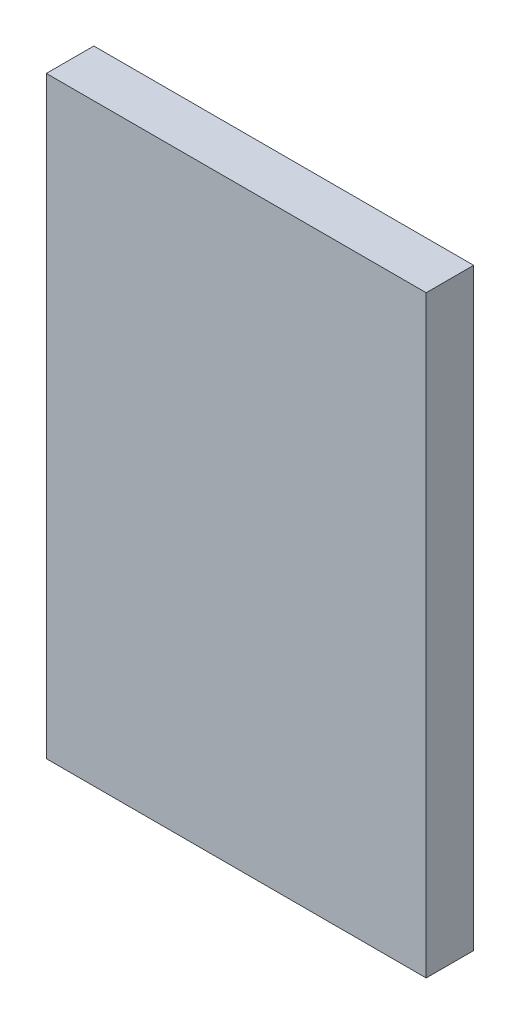
ISO-10303-21;
HEADER;
FILE_DESCRIPTION(('STEP AP214'),'2;1');
FILE_NAME('part.step','',(''),(''),'','','');
FILE_SCHEMA(('AUTOMOTIVE_DESIGN { 1 0 10303 214 1 1 1 1 }'));
ENDSEC;
DATA;
#1=APPLICATION_CONTEXT('core data for automotive mechanical design processes');
#2=APPLICATION_PROTOCOL_DEFINITION('international standard','automotive_design',2000,#1);
#3=PRODUCT_CONTEXT('',#1,'mechanical');
#4=PRODUCT('Part','Part','',(#3));
#5=PRODUCT_RELATED_PRODUCT_CATEGORY('part','',(#4));
#6=PRODUCT_DEFINITION_FORMATION('','',#4);
#7=PRODUCT_DEFINITION_CONTEXT('part definition',#1,'design');
#8=PRODUCT_DEFINITION('design','',#6,#7);
#9=PRODUCT_DEFINITION_SHAPE('','',#8);
#10=(LENGTH_UNIT() NAMED_UNIT(*) SI_UNIT(.MILLI.,.METRE.));
#11=(NAMED_UNIT(*) PLANE_ANGLE_UNIT() SI_UNIT($,.RADIAN.));
#12=(NAMED_UNIT(*) SI_UNIT($,.STERADIAN.) SOLID_ANGLE_UNIT());
#13=UNCERTAINTY_MEASURE_WITH_UNIT(LENGTH_MEASURE(1.E-05),#10,'distance_accuracy_value','');
#14=(GEOMETRIC_REPRESENTATION_CONTEXT(3) GLOBAL_UNCERTAINTY_ASSIGNED_CONTEXT((#13)) GLOBAL_UNIT_ASSIGNED_CONTEXT((#10,
#11,#12)) REPRESENTATION_CONTEXT('',''));
#15=CARTESIAN_POINT('',(0.,0.,0.));
#16=DIRECTION('',(0.,0.,1.));
#17=DIRECTION('',(1.,0.,0.));
#18=AXIS2_PLACEMENT_3D('',#15,#16,#17);
#19=CARTESIAN_POINT('',(0.,0.,10.));
#20=DIRECTION('',(1.,0.,0.));
#21=DIRECTION('',(0.,0.,-1.));
#22=AXIS2_PLACEMENT_3D('',#19,#20,#21);
#23=PLANE('',#22);
#24=DIRECTION('',(0.,-1.,0.));
#25=VECTOR('',#24,1.);
#26=CARTESIAN_POINT('',(0.,0.,0.));
#27=LINE('',#26,#25);
#28=CARTESIAN_POINT('',(0.,125.,0.));
#29=VERTEX_POINT('',#28);
#30=CARTESIAN_POINT('',(0.,0.,0.));
#31=VERTEX_POINT('',#30);
#32=EDGE_CURVE('E95',#29,#31,#27,.T.);
#33=ORIENTED_EDGE('',*,*,#32,.T.);
#34=DIRECTION('',(0.,0.,-1.));
#35=VECTOR('',#34,1.);
#36=CARTESIAN_POINT('',(0.,0.,10.));
#37=LINE('',#36,#35);
#38=CARTESIAN_POINT('',(0.,0.,10.));
#39=VERTEX_POINT('',#38);
#40=EDGE_CURVE('E11',#39,#31,#37,.T.);
#41=ORIENTED_EDGE('',*,*,#40,.F.);
#42=DIRECTION('',(0.,-1.,0.));
#43=VECTOR('',#42,1.);
#44=CARTESIAN_POINT('',(0.,0.,10.));
#45=LINE('',#44,#43);
#46=CARTESIAN_POINT('',(0.,125.,10.));
#47=VERTEX_POINT('',#46);
#48=EDGE_CURVE('E83',#47,#39,#45,.T.);
#49=ORIENTED_EDGE('',*,*,#48,.F.);
#50=DIRECTION('',(0.,0.,-1.));
#51=VECTOR('',#50,1.);
#52=CARTESIAN_POINT('',(0.,125.,10.));
#53=LINE('',#52,#51);
#54=EDGE_CURVE('E91',#47,#29,#53,.T.);
#55=ORIENTED_EDGE('',*,*,#54,.T.);
#56=EDGE_LOOP('',(#33,#41,#49,#55));
#57=FACE_BOUND('',#56,.T.);
#58=ADVANCED_FACE('F32',(#57),#23,.F.);
#59=CARTESIAN_POINT('',(0.,0.,10.));
#60=DIRECTION('',(0.,1.,0.));
#61=DIRECTION('',(0.,0.,1.));
#62=AXIS2_PLACEMENT_3D('',#59,#60,#61);
#63=PLANE('',#62);
#64=DIRECTION('',(1.,0.,0.));
#65=VECTOR('',#64,1.);
#66=CARTESIAN_POINT('',(0.,0.,0.));
#67=LINE('',#66,#65);
#68=CARTESIAN_POINT('',(80.,0.,0.));
#69=VERTEX_POINT('',#68);
#70=EDGE_CURVE('E87',#31,#69,#67,.T.);
#71=ORIENTED_EDGE('',*,*,#70,.T.);
#72=DIRECTION('',(0.,0.,-1.));
#73=VECTOR('',#72,1.);
#74=CARTESIAN_POINT('',(80.,0.,10.));
#75=LINE('',#74,#73);
#76=CARTESIAN_POINT('',(80.,0.,10.));
#77=VERTEX_POINT('',#76);
#78=EDGE_CURVE('E40',#77,#69,#75,.T.);
#79=ORIENTED_EDGE('',*,*,#78,.F.);
#80=DIRECTION('',(1.,0.,0.));
#81=VECTOR('',#80,1.);
#82=CARTESIAN_POINT('',(0.,0.,10.));
#83=LINE('',#82,#81);
#84=EDGE_CURVE('E78',#39,#77,#83,.T.);
#85=ORIENTED_EDGE('',*,*,#84,.F.);
#86=ORIENTED_EDGE('',*,*,#40,.T.);
#87=EDGE_LOOP('',(#71,#79,#85,#86));
#88=FACE_BOUND('',#87,.T.);
#89=ADVANCED_FACE('F86',(#88),#63,.F.);
#90=CARTESIAN_POINT('',(80.,0.,10.));
#91=DIRECTION('',(-1.,0.,0.));
#92=DIRECTION('',(0.,0.,1.));
#93=AXIS2_PLACEMENT_3D('',#90,#91,#92);
#94=PLANE('',#93);
#95=DIRECTION('',(0.,1.,0.));
#96=VECTOR('',#95,1.);
#97=CARTESIAN_POINT('',(80.,0.,0.));
#98=LINE('',#97,#96);
#99=CARTESIAN_POINT('',(80.,125.,0.));
#100=VERTEX_POINT('',#99);
#101=EDGE_CURVE('E65',#69,#100,#98,.T.);
#102=ORIENTED_EDGE('',*,*,#101,.T.);
#103=DIRECTION('',(0.,0.,-1.));
#104=VECTOR('',#103,1.);
#105=CARTESIAN_POINT('',(80.,125.,10.));
#106=LINE('',#105,#104);
#107=CARTESIAN_POINT('',(80.,125.,10.));
#108=VERTEX_POINT('',#107);
#109=EDGE_CURVE('E88',#108,#100,#106,.T.);
#110=ORIENTED_EDGE('',*,*,#109,.F.);
#111=DIRECTION('',(0.,1.,0.));
#112=VECTOR('',#111,1.);
#113=CARTESIAN_POINT('',(80.,0.,10.));
#114=LINE('',#113,#112);
#115=EDGE_CURVE('E81',#77,#108,#114,.T.);
#116=ORIENTED_EDGE('',*,*,#115,.F.);
#117=ORIENTED_EDGE('',*,*,#78,.T.);
#118=EDGE_LOOP('',(#102,#110,#116,#117));
#119=FACE_BOUND('',#118,.T.);
#120=ADVANCED_FACE('F89',(#119),#94,.F.);
#121=CARTESIAN_POINT('',(0.,125.,10.));
#122=DIRECTION('',(0.,-1.,0.));
#123=DIRECTION('',(0.,0.,-1.));
#124=AXIS2_PLACEMENT_3D('',#121,#122,#123);
#125=PLANE('',#124);
#126=DIRECTION('',(-1.,0.,0.));
#127=VECTOR('',#126,1.);
#128=CARTESIAN_POINT('',(0.,125.,0.));
#129=LINE('',#128,#127);
#130=EDGE_CURVE('E71',#100,#29,#129,.T.);
#131=ORIENTED_EDGE('',*,*,#130,.T.);
#132=ORIENTED_EDGE('',*,*,#54,.F.);
#133=DIRECTION('',(-1.,0.,0.));
#134=VECTOR('',#133,1.);
#135=CARTESIAN_POINT('',(0.,125.,10.));
#136=LINE('',#135,#134);
#137=EDGE_CURVE('E48',#108,#47,#136,.T.);
#138=ORIENTED_EDGE('',*,*,#137,.F.);
#139=ORIENTED_EDGE('',*,*,#109,.T.);
#140=EDGE_LOOP('',(#131,#132,#138,#139));
#141=FACE_BOUND('',#140,.T.);
#142=ADVANCED_FACE('F102',(#141),#125,.F.);
#143=CARTESIAN_POINT('',(0.,0.,10.));
#144=DIRECTION('',(0.,0.,-1.));
#145=DIRECTION('',(-1.,0.,0.));
#146=AXIS2_PLACEMENT_3D('',#143,#144,#145);
#147=PLANE('',#146);
#148=ORIENTED_EDGE('',*,*,#48,.T.);
#149=ORIENTED_EDGE('',*,*,#84,.T.);
#150=ORIENTED_EDGE('',*,*,#115,.T.);
#151=ORIENTED_EDGE('',*,*,#137,.T.);
#152=EDGE_LOOP('',(#148,#149,#150,#151));
#153=FACE_BOUND('',#152,.T.);
#154=ADVANCED_FACE('F79',(#153),#147,.F.);
#155=CARTESIAN_POINT('',(0.,0.,0.));
#156=DIRECTION('',(0.,0.,-1.));
#157=DIRECTION('',(-1.,0.,0.));
#158=AXIS2_PLACEMENT_3D('',#155,#156,#157);
#159=PLANE('',#158);
#160=ORIENTED_EDGE('',*,*,#32,.F.);
#161=ORIENTED_EDGE('',*,*,#130,.F.);
#162=ORIENTED_EDGE('',*,*,#101,.F.);
#163=ORIENTED_EDGE('',*,*,#70,.F.);
#164=EDGE_LOOP('',(#160,#161,#162,#163));
#165=FACE_BOUND('',#164,.T.);
#166=ADVANCED_FACE('F105',(#165),#159,.T.);
#167=CLOSED_SHELL('',(#58,#89,#120,#142,#154,#166));
#168=MANIFOLD_SOLID_BREP('B2',#167);
#169=ADVANCED_BREP_SHAPE_REPRESENTATION('',(#18,#168),#14);
#170=SHAPE_DEFINITION_REPRESENTATION(#9,#169);
ENDSEC;
END-ISO-10303-21;
